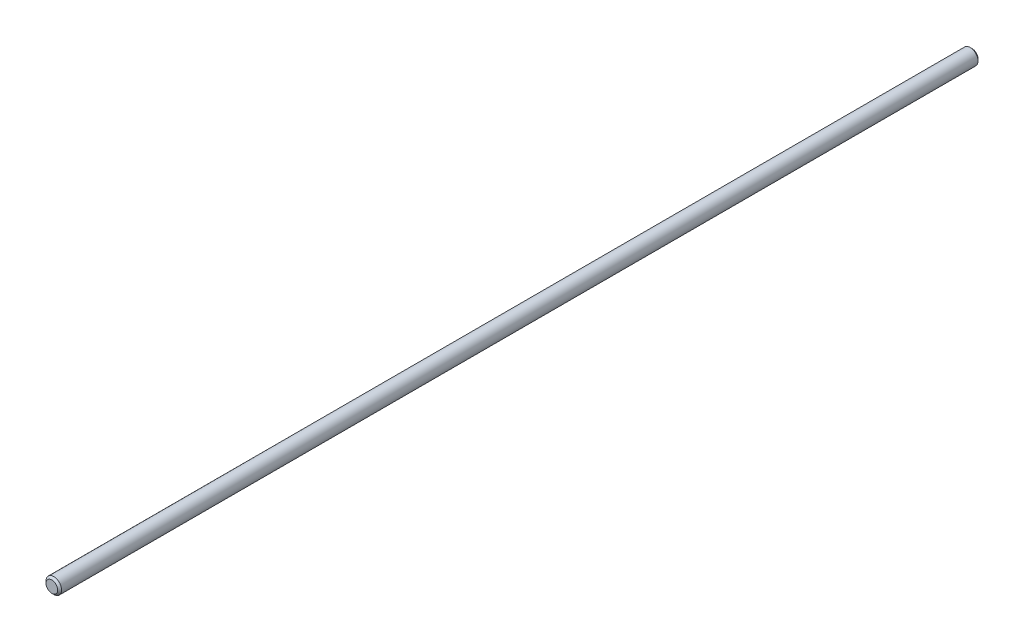
ISO-10303-21;
HEADER;
FILE_DESCRIPTION(('STEP AP214'),'2;1');
FILE_NAME('part.step','',(''),(''),'','','');
FILE_SCHEMA(('AUTOMOTIVE_DESIGN { 1 0 10303 214 1 1 1 1 }'));
ENDSEC;
DATA;
#1=APPLICATION_CONTEXT('core data for automotive mechanical design processes');
#2=APPLICATION_PROTOCOL_DEFINITION('international standard','automotive_design',2000,#1);
#3=PRODUCT_CONTEXT('',#1,'mechanical');
#4=PRODUCT('Part','Part','',(#3));
#5=PRODUCT_RELATED_PRODUCT_CATEGORY('part','',(#4));
#6=PRODUCT_DEFINITION_FORMATION('','',#4);
#7=PRODUCT_DEFINITION_CONTEXT('part definition',#1,'design');
#8=PRODUCT_DEFINITION('design','',#6,#7);
#9=PRODUCT_DEFINITION_SHAPE('','',#8);
#10=(LENGTH_UNIT() NAMED_UNIT(*) SI_UNIT(.MILLI.,.METRE.));
#11=(NAMED_UNIT(*) PLANE_ANGLE_UNIT() SI_UNIT($,.RADIAN.));
#12=(NAMED_UNIT(*) SI_UNIT($,.STERADIAN.) SOLID_ANGLE_UNIT());
#13=UNCERTAINTY_MEASURE_WITH_UNIT(LENGTH_MEASURE(1.E-05),#10,'distance_accuracy_value','');
#14=(GEOMETRIC_REPRESENTATION_CONTEXT(3) GLOBAL_UNCERTAINTY_ASSIGNED_CONTEXT((#13)) GLOBAL_UNIT_ASSIGNED_CONTEXT((#10,
#11,#12)) REPRESENTATION_CONTEXT('',''));
#15=CARTESIAN_POINT('',(0.,0.,0.));
#16=DIRECTION('',(0.,0.,1.));
#17=DIRECTION('',(1.,0.,0.));
#18=AXIS2_PLACEMENT_3D('',#15,#16,#17);
#19=CARTESIAN_POINT('',(0.,0.,470.));
#20=DIRECTION('',(0.,0.,-1.));
#21=DIRECTION('',(-1.,0.,0.));
#22=AXIS2_PLACEMENT_3D('',#19,#20,#21);
#23=CYLINDRICAL_SURFACE('',#22,3.975);
#24=CARTESIAN_POINT('',(0.,0.,1.00000000000022));
#25=DIRECTION('',(0.,0.,1.));
#26=DIRECTION('',(1.,0.,0.));
#27=AXIS2_PLACEMENT_3D('',#24,#25,#26);
#28=CIRCLE('',#27,3.975);
#29=CARTESIAN_POINT('',(3.975,0.,1.00000000000022));
#30=VERTEX_POINT('',#29);
#31=EDGE_CURVE('E45',#30,#30,#28,.T.);
#32=ORIENTED_EDGE('',*,*,#31,.T.);
#33=EDGE_LOOP('',(#32));
#34=FACE_BOUND('',#33,.T.);
#35=CARTESIAN_POINT('',(0.,0.,469.));
#36=DIRECTION('',(0.,0.,1.));
#37=DIRECTION('',(1.,0.,0.));
#38=AXIS2_PLACEMENT_3D('',#35,#36,#37);
#39=CIRCLE('',#38,3.975);
#40=CARTESIAN_POINT('',(3.975,0.,469.));
#41=VERTEX_POINT('',#40);
#42=EDGE_CURVE('E49',#41,#41,#39,.F.);
#43=ORIENTED_EDGE('',*,*,#42,.T.);
#44=EDGE_LOOP('',(#43));
#45=FACE_BOUND('',#44,.T.);
#46=ADVANCED_FACE('F33',(#34,#45),#23,.T.);
#47=CARTESIAN_POINT('',(0.,0.,470.));
#48=DIRECTION('',(0.,0.,1.));
#49=DIRECTION('',(1.,0.,0.));
#50=AXIS2_PLACEMENT_3D('',#47,#48,#49);
#51=PLANE('',#50);
#52=CARTESIAN_POINT('',(0.,0.,470.));
#53=DIRECTION('',(0.,0.,1.));
#54=DIRECTION('',(1.,0.,0.));
#55=AXIS2_PLACEMENT_3D('',#52,#53,#54);
#56=CIRCLE('',#55,2.97500000000023);
#57=CARTESIAN_POINT('',(2.97500000000023,0.,470.));
#58=VERTEX_POINT('',#57);
#59=EDGE_CURVE('E10',#58,#58,#56,.T.);
#60=ORIENTED_EDGE('',*,*,#59,.T.);
#61=EDGE_LOOP('',(#60));
#62=FACE_BOUND('',#61,.T.);
#63=ADVANCED_FACE('F65',(#62),#51,.T.);
#64=CARTESIAN_POINT('',(0.,0.,0.));
#65=DIRECTION('',(0.,0.,1.));
#66=DIRECTION('',(1.,0.,0.));
#67=AXIS2_PLACEMENT_3D('',#64,#65,#66);
#68=PLANE('',#67);
#69=CARTESIAN_POINT('',(0.,0.,0.));
#70=DIRECTION('',(0.,0.,1.));
#71=DIRECTION('',(1.,0.,0.));
#72=AXIS2_PLACEMENT_3D('',#69,#70,#71);
#73=CIRCLE('',#72,2.97499999999978);
#74=CARTESIAN_POINT('',(2.97499999999978,0.,0.));
#75=VERTEX_POINT('',#74);
#76=EDGE_CURVE('E41',#75,#75,#73,.F.);
#77=ORIENTED_EDGE('',*,*,#76,.T.);
#78=EDGE_LOOP('',(#77));
#79=FACE_BOUND('',#78,.T.);
#80=ADVANCED_FACE('F62',(#79),#68,.F.);
#81=CARTESIAN_POINT('',(0.,0.,1.00000000000022));
#82=DIRECTION('',(0.,0.,1.));
#83=DIRECTION('',(1.,0.,0.));
#84=AXIS2_PLACEMENT_3D('',#81,#82,#83);
#85=CONICAL_SURFACE('',#84,3.975,0.785398163397446);
#86=ORIENTED_EDGE('',*,*,#76,.F.);
#87=EDGE_LOOP('',(#86));
#88=FACE_BOUND('',#87,.T.);
#89=ORIENTED_EDGE('',*,*,#31,.F.);
#90=EDGE_LOOP('',(#89));
#91=FACE_BOUND('',#90,.T.);
#92=ADVANCED_FACE('F58',(#88,#91),#85,.T.);
#93=CARTESIAN_POINT('',(0.,0.,470.));
#94=DIRECTION('',(0.,0.,-1.));
#95=DIRECTION('',(-1.,0.,0.));
#96=AXIS2_PLACEMENT_3D('',#93,#94,#95);
#97=CONICAL_SURFACE('',#96,2.97500000000023,0.785398163397445);
#98=ORIENTED_EDGE('',*,*,#42,.F.);
#99=EDGE_LOOP('',(#98));
#100=FACE_BOUND('',#99,.T.);
#101=ORIENTED_EDGE('',*,*,#59,.F.);
#102=EDGE_LOOP('',(#101));
#103=FACE_BOUND('',#102,.T.);
#104=ADVANCED_FACE('F36',(#100,#103),#97,.T.);
#105=CLOSED_SHELL('',(#46,#63,#80,#92,#104));
#106=MANIFOLD_SOLID_BREP('B2',#105);
#107=ADVANCED_BREP_SHAPE_REPRESENTATION('',(#18,#106),#14);
#108=SHAPE_DEFINITION_REPRESENTATION(#9,#107);
ENDSEC;
END-ISO-10303-21;
